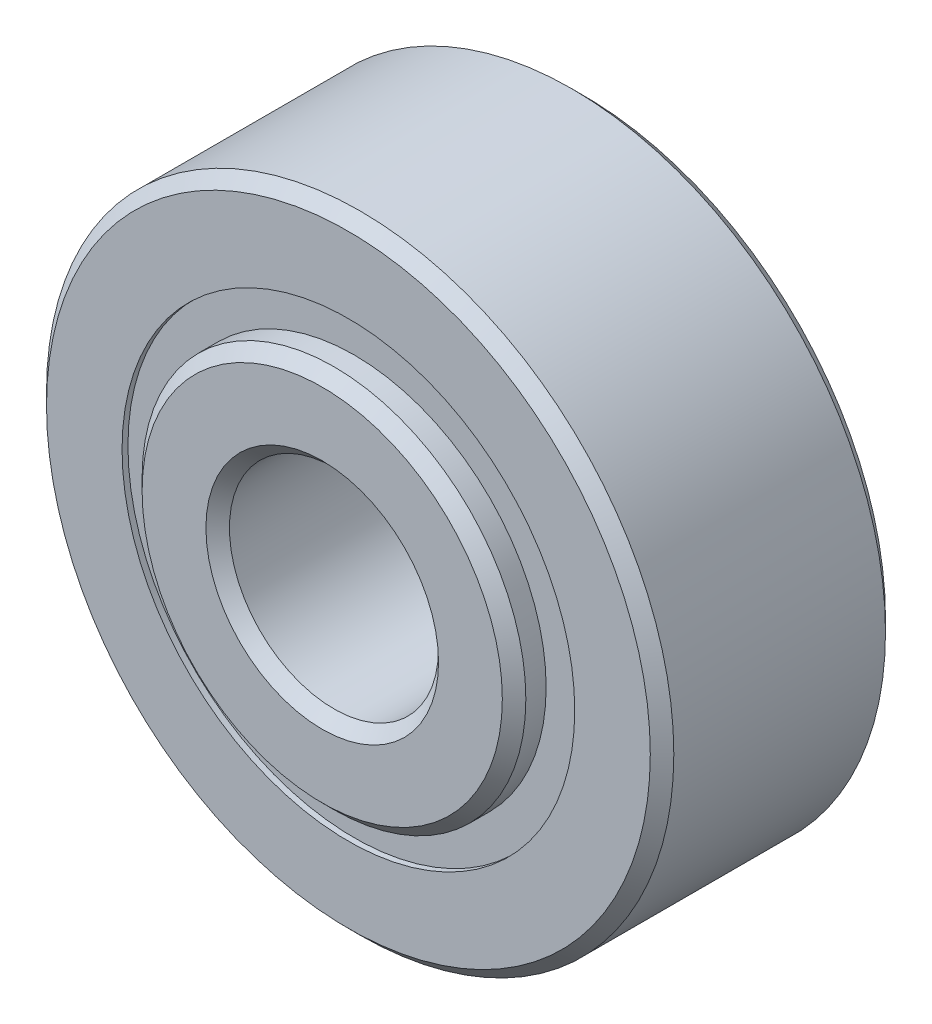
ISO-10303-21;
HEADER;
FILE_DESCRIPTION(('STEP AP214'),'2;1');
FILE_NAME('part.step','',(''),(''),'','','');
FILE_SCHEMA(('AUTOMOTIVE_DESIGN { 1 0 10303 214 1 1 1 1 }'));
ENDSEC;
DATA;
#1=APPLICATION_CONTEXT('core data for automotive mechanical design processes');
#2=APPLICATION_PROTOCOL_DEFINITION('international standard','automotive_design',2000,#1);
#3=PRODUCT_CONTEXT('',#1,'mechanical');
#4=PRODUCT('Part','Part','',(#3));
#5=PRODUCT_RELATED_PRODUCT_CATEGORY('part','',(#4));
#6=PRODUCT_DEFINITION_FORMATION('','',#4);
#7=PRODUCT_DEFINITION_CONTEXT('part definition',#1,'design');
#8=PRODUCT_DEFINITION('design','',#6,#7);
#9=PRODUCT_DEFINITION_SHAPE('','',#8);
#10=(LENGTH_UNIT() NAMED_UNIT(*) SI_UNIT(.MILLI.,.METRE.));
#11=(NAMED_UNIT(*) PLANE_ANGLE_UNIT() SI_UNIT($,.RADIAN.));
#12=(NAMED_UNIT(*) SI_UNIT($,.STERADIAN.) SOLID_ANGLE_UNIT());
#13=UNCERTAINTY_MEASURE_WITH_UNIT(LENGTH_MEASURE(1.E-05),#10,'distance_accuracy_value','');
#14=(GEOMETRIC_REPRESENTATION_CONTEXT(3) GLOBAL_UNCERTAINTY_ASSIGNED_CONTEXT((#13)) GLOBAL_UNIT_ASSIGNED_CONTEXT((#10,
#11,#12)) REPRESENTATION_CONTEXT('',''));
#15=CARTESIAN_POINT('',(0.,0.,0.));
#16=DIRECTION('',(0.,0.,1.));
#17=DIRECTION('',(1.,0.,0.));
#18=AXIS2_PLACEMENT_3D('',#15,#16,#17);
#19=CARTESIAN_POINT('',(0.,3.43670373626374,-1.696339));
#20=DIRECTION('',(0.,0.,1.));
#21=DIRECTION('',(1.,0.,0.));
#22=AXIS2_PLACEMENT_3D('',#19,#20,#21);
#23=PLANE('',#22);
#24=CARTESIAN_POINT('',(0.,0.,-1.696339));
#25=DIRECTION('',(0.,0.,1.));
#26=DIRECTION('',(1.,0.,0.));
#27=AXIS2_PLACEMENT_3D('',#24,#25,#26);
#28=CIRCLE('',#27,3.43670373626374);
#29=CARTESIAN_POINT('',(3.43670373626374,0.,-1.696339));
#30=VERTEX_POINT('',#29);
#31=EDGE_CURVE('E60',#30,#30,#28,.T.);
#32=ORIENTED_EDGE('',*,*,#31,.F.);
#33=EDGE_LOOP('',(#32));
#34=FACE_BOUND('',#33,.T.);
#35=CARTESIAN_POINT('',(0.,0.,-1.696339));
#36=DIRECTION('',(0.,0.,1.));
#37=DIRECTION('',(1.,0.,0.));
#38=AXIS2_PLACEMENT_3D('',#35,#36,#37);
#39=CIRCLE('',#38,2.91329626373626);
#40=CARTESIAN_POINT('',(2.91329626373626,0.,-1.696339));
#41=VERTEX_POINT('',#40);
#42=EDGE_CURVE('E11',#41,#41,#39,.T.);
#43=ORIENTED_EDGE('',*,*,#42,.T.);
#44=EDGE_LOOP('',(#43));
#45=FACE_BOUND('',#44,.T.);
#46=ADVANCED_FACE('F46',(#34,#45),#23,.F.);
#47=CARTESIAN_POINT('',(0.,0.,1.78562));
#48=DIRECTION('',(0.,0.,1.));
#49=DIRECTION('',(1.,0.,0.));
#50=AXIS2_PLACEMENT_3D('',#47,#48,#49);
#51=CYLINDRICAL_SURFACE('',#50,2.91329626373626);
#52=ORIENTED_EDGE('',*,*,#42,.F.);
#53=EDGE_LOOP('',(#52));
#54=FACE_BOUND('',#53,.T.);
#55=CARTESIAN_POINT('',(0.,0.,-0.8356458066058));
#56=DIRECTION('',(0.,0.,1.));
#57=DIRECTION('',(1.,0.,0.));
#58=AXIS2_PLACEMENT_3D('',#55,#56,#57);
#59=CIRCLE('',#58,2.91329626373626);
#60=CARTESIAN_POINT('',(2.91329626373626,0.,-0.8356458066058));
#61=VERTEX_POINT('',#60);
#62=EDGE_CURVE('E52',#61,#61,#59,.T.);
#63=ORIENTED_EDGE('',*,*,#62,.T.);
#64=EDGE_LOOP('',(#63));
#65=FACE_BOUND('',#64,.T.);
#66=ADVANCED_FACE('F69',(#54,#65),#51,.F.);
#67=CARTESIAN_POINT('',(0.,3.43670373626374,-0.8356458066058));
#68=DIRECTION('',(0.,0.,-1.));
#69=DIRECTION('',(-1.,0.,0.));
#70=AXIS2_PLACEMENT_3D('',#67,#68,#69);
#71=PLANE('',#70);
#72=ORIENTED_EDGE('',*,*,#62,.F.);
#73=EDGE_LOOP('',(#72));
#74=FACE_BOUND('',#73,.T.);
#75=CARTESIAN_POINT('',(0.,0.,-0.835645806605799));
#76=DIRECTION('',(0.,0.,1.));
#77=DIRECTION('',(1.,0.,0.));
#78=AXIS2_PLACEMENT_3D('',#75,#76,#77);
#79=CIRCLE('',#78,3.43670373626374);
#80=CARTESIAN_POINT('',(3.43670373626374,0.,-0.835645806605799));
#81=VERTEX_POINT('',#80);
#82=EDGE_CURVE('E56',#81,#81,#79,.T.);
#83=ORIENTED_EDGE('',*,*,#82,.T.);
#84=EDGE_LOOP('',(#83));
#85=FACE_BOUND('',#84,.T.);
#86=ADVANCED_FACE('F73',(#74,#85),#71,.F.);
#87=CARTESIAN_POINT('',(0.,0.,1.78562));
#88=DIRECTION('',(0.,0.,1.));
#89=DIRECTION('',(1.,0.,0.));
#90=AXIS2_PLACEMENT_3D('',#87,#88,#89);
#91=CYLINDRICAL_SURFACE('',#90,3.43670373626374);
#92=ORIENTED_EDGE('',*,*,#82,.F.);
#93=EDGE_LOOP('',(#92));
#94=FACE_BOUND('',#93,.T.);
#95=ORIENTED_EDGE('',*,*,#31,.T.);
#96=EDGE_LOOP('',(#95));
#97=FACE_BOUND('',#96,.T.);
#98=ADVANCED_FACE('F66',(#94,#97),#91,.T.);
#99=CLOSED_SHELL('',(#46,#66,#86,#98));
#100=MANIFOLD_SOLID_BREP('B2',#99);
#101=CARTESIAN_POINT('',(0.,3.43670373626374,1.696339));
#102=DIRECTION('',(0.,0.,-1.));
#103=DIRECTION('',(-1.,0.,0.));
#104=AXIS2_PLACEMENT_3D('',#101,#102,#103);
#105=PLANE('',#104);
#106=CARTESIAN_POINT('',(0.,0.,1.696339));
#107=DIRECTION('',(0.,0.,1.));
#108=DIRECTION('',(1.,0.,0.));
#109=AXIS2_PLACEMENT_3D('',#106,#107,#108);
#110=CIRCLE('',#109,2.91329626373626);
#111=CARTESIAN_POINT('',(2.91329626373626,0.,1.696339));
#112=VERTEX_POINT('',#111);
#113=EDGE_CURVE('E45',#112,#112,#110,.T.);
#114=ORIENTED_EDGE('',*,*,#113,.F.);
#115=EDGE_LOOP('',(#114));
#116=FACE_BOUND('',#115,.T.);
#117=CARTESIAN_POINT('',(0.,0.,1.696339));
#118=DIRECTION('',(0.,0.,1.));
#119=DIRECTION('',(1.,0.,0.));
#120=AXIS2_PLACEMENT_3D('',#117,#118,#119);
#121=CIRCLE('',#120,3.43670373626374);
#122=CARTESIAN_POINT('',(3.43670373626374,0.,1.696339));
#123=VERTEX_POINT('',#122);
#124=EDGE_CURVE('E128',#123,#123,#121,.T.);
#125=ORIENTED_EDGE('',*,*,#124,.T.);
#126=EDGE_LOOP('',(#125));
#127=FACE_BOUND('',#126,.T.);
#128=ADVANCED_FACE('F114',(#116,#127),#105,.F.);
#129=CARTESIAN_POINT('',(0.,0.,1.78562));
#130=DIRECTION('',(0.,0.,1.));
#131=DIRECTION('',(1.,0.,0.));
#132=AXIS2_PLACEMENT_3D('',#129,#130,#131);
#133=CYLINDRICAL_SURFACE('',#132,2.91329626373626);
#134=CARTESIAN_POINT('',(0.,0.,0.835645806605798));
#135=DIRECTION('',(0.,0.,1.));
#136=DIRECTION('',(1.,0.,0.));
#137=AXIS2_PLACEMENT_3D('',#134,#135,#136);
#138=CIRCLE('',#137,2.91329626373626);
#139=CARTESIAN_POINT('',(2.91329626373626,0.,0.835645806605798));
#140=VERTEX_POINT('',#139);
#141=EDGE_CURVE('E120',#140,#140,#138,.T.);
#142=ORIENTED_EDGE('',*,*,#141,.F.);
#143=EDGE_LOOP('',(#142));
#144=FACE_BOUND('',#143,.T.);
#145=ORIENTED_EDGE('',*,*,#113,.T.);
#146=EDGE_LOOP('',(#145));
#147=FACE_BOUND('',#146,.T.);
#148=ADVANCED_FACE('F143',(#144,#147),#133,.F.);
#149=CARTESIAN_POINT('',(0.,3.43670373626374,0.835645806605798));
#150=DIRECTION('',(0.,0.,1.));
#151=DIRECTION('',(1.,0.,0.));
#152=AXIS2_PLACEMENT_3D('',#149,#150,#151);
#153=PLANE('',#152);
#154=CARTESIAN_POINT('',(0.,0.,0.835645806605798));
#155=DIRECTION('',(0.,0.,1.));
#156=DIRECTION('',(1.,0.,0.));
#157=AXIS2_PLACEMENT_3D('',#154,#155,#156);
#158=CIRCLE('',#157,3.43670373626374);
#159=CARTESIAN_POINT('',(3.43670373626374,0.,0.835645806605798));
#160=VERTEX_POINT('',#159);
#161=EDGE_CURVE('E124',#160,#160,#158,.T.);
#162=ORIENTED_EDGE('',*,*,#161,.F.);
#163=EDGE_LOOP('',(#162));
#164=FACE_BOUND('',#163,.T.);
#165=ORIENTED_EDGE('',*,*,#141,.T.);
#166=EDGE_LOOP('',(#165));
#167=FACE_BOUND('',#166,.T.);
#168=ADVANCED_FACE('F138',(#164,#167),#153,.F.);
#169=CARTESIAN_POINT('',(0.,0.,1.78562));
#170=DIRECTION('',(0.,0.,1.));
#171=DIRECTION('',(1.,0.,0.));
#172=AXIS2_PLACEMENT_3D('',#169,#170,#171);
#173=CYLINDRICAL_SURFACE('',#172,3.43670373626374);
#174=ORIENTED_EDGE('',*,*,#124,.F.);
#175=EDGE_LOOP('',(#174));
#176=FACE_BOUND('',#175,.T.);
#177=ORIENTED_EDGE('',*,*,#161,.T.);
#178=EDGE_LOOP('',(#177));
#179=FACE_BOUND('',#178,.T.);
#180=ADVANCED_FACE('F135',(#176,#179),#173,.T.);
#181=CLOSED_SHELL('',(#128,#148,#168,#180));
#182=MANIFOLD_SOLID_BREP('B6',#181);
#183=CARTESIAN_POINT('',(-1.86621817602857,2.56862895714048,0.));
#184=DIRECTION('',(0.,0.,1.));
#185=DIRECTION('',(-0.587785252292462,0.809016994374955,0.));
#186=AXIS2_PLACEMENT_3D('',#183,#184,#185);
#187=SPHERICAL_SURFACE('',#186,0.835645806605799);
#188=CARTESIAN_POINT('',(-1.86621817602857,2.56862895714048,0.835645806605798));
#189=VERTEX_POINT('',#188);
#190=VERTEX_LOOP('',#189);
#191=FACE_BOUND('',#190,.T.);
#192=ADVANCED_FACE('F181',(#191),#187,.T.);
#193=CLOSED_SHELL('',(#192));
#194=MANIFOLD_SOLID_BREP('B40',#193);
#195=CARTESIAN_POINT('',(-3.0196044392371,0.981128957140492,0.));
#196=DIRECTION('',(0.,0.,1.));
#197=DIRECTION('',(-0.95105651629515,0.309016994374958,0.));
#198=AXIS2_PLACEMENT_3D('',#195,#196,#197);
#199=SPHERICAL_SURFACE('',#198,0.835645806605799);
#200=CARTESIAN_POINT('',(-3.0196044392371,0.981128957140492,0.835645806605798));
#201=VERTEX_POINT('',#200);
#202=VERTEX_LOOP('',#201);
#203=FACE_BOUND('',#202,.T.);
#204=ADVANCED_FACE('F201',(#203),#199,.T.);
#205=CLOSED_SHELL('',(#204));
#206=MANIFOLD_SOLID_BREP('B110',#205);
#207=CARTESIAN_POINT('',(-3.01960443923712,-0.981128957140429,0.));
#208=DIRECTION('',(0.,0.,1.));
#209=DIRECTION('',(-0.951056516295157,-0.309016994374938,0.));
#210=AXIS2_PLACEMENT_3D('',#207,#208,#209);
#211=SPHERICAL_SURFACE('',#210,0.835645806605799);
#212=CARTESIAN_POINT('',(-3.01960443923712,-0.981128957140429,0.835645806605798));
#213=VERTEX_POINT('',#212);
#214=VERTEX_LOOP('',#213);
#215=FACE_BOUND('',#214,.T.);
#216=ADVANCED_FACE('F221',(#215),#211,.T.);
#217=CLOSED_SHELL('',(#216));
#218=MANIFOLD_SOLID_BREP('B177',#217);
#219=CARTESIAN_POINT('',(-1.86621817602862,-2.56862895714044,0.));
#220=DIRECTION('',(0.,0.,1.));
#221=DIRECTION('',(-0.58778525229248,-0.809016994374942,0.));
#222=AXIS2_PLACEMENT_3D('',#219,#220,#221);
#223=SPHERICAL_SURFACE('',#222,0.835645806605799);
#224=CARTESIAN_POINT('',(-1.86621817602862,-2.56862895714044,0.835645806605798));
#225=VERTEX_POINT('',#224);
#226=VERTEX_LOOP('',#225);
#227=FACE_BOUND('',#226,.T.);
#228=ADVANCED_FACE('F241',(#227),#223,.T.);
#229=CLOSED_SHELL('',(#228));
#230=MANIFOLD_SOLID_BREP('B197',#229);
#231=CARTESIAN_POINT('',(0.,-3.175,0.));
#232=DIRECTION('',(0.,0.,1.));
#233=DIRECTION('',(0.,-1.,0.));
#234=AXIS2_PLACEMENT_3D('',#231,#232,#233);
#235=SPHERICAL_SURFACE('',#234,0.835645806605799);
#236=CARTESIAN_POINT('',(0.,-3.175,0.835645806605798));
#237=VERTEX_POINT('',#236);
#238=VERTEX_LOOP('',#237);
#239=FACE_BOUND('',#238,.T.);
#240=ADVANCED_FACE('F261',(#239),#235,.T.);
#241=CLOSED_SHELL('',(#240));
#242=MANIFOLD_SOLID_BREP('B217',#241);
#243=CARTESIAN_POINT('',(1.86621817602859,-2.56862895714047,0.));
#244=DIRECTION('',(0.,0.,1.));
#245=DIRECTION('',(0.587785252292469,-0.809016994374951,0.));
#246=AXIS2_PLACEMENT_3D('',#243,#244,#245);
#247=SPHERICAL_SURFACE('',#246,0.835645806605799);
#248=CARTESIAN_POINT('',(1.86621817602859,-2.56862895714047,0.835645806605798));
#249=VERTEX_POINT('',#248);
#250=VERTEX_LOOP('',#249);
#251=FACE_BOUND('',#250,.T.);
#252=ADVANCED_FACE('F281',(#251),#247,.T.);
#253=CLOSED_SHELL('',(#252));
#254=MANIFOLD_SOLID_BREP('B237',#253);
#255=CARTESIAN_POINT('',(3.01960443923711,-0.981128957140471,0.));
#256=DIRECTION('',(0.,0.,1.));
#257=DIRECTION('',(0.951056516295152,-0.309016994374952,0.));
#258=AXIS2_PLACEMENT_3D('',#255,#256,#257);
#259=SPHERICAL_SURFACE('',#258,0.835645806605799);
#260=CARTESIAN_POINT('',(3.01960443923711,-0.981128957140471,0.835645806605798));
#261=VERTEX_POINT('',#260);
#262=VERTEX_LOOP('',#261);
#263=FACE_BOUND('',#262,.T.);
#264=ADVANCED_FACE('F301',(#263),#259,.T.);
#265=CLOSED_SHELL('',(#264));
#266=MANIFOLD_SOLID_BREP('B257',#265);
#267=CARTESIAN_POINT('',(3.01960443923712,0.98112895714045,0.));
#268=DIRECTION('',(0.,0.,1.));
#269=DIRECTION('',(0.951056516295155,0.309016994374945,0.));
#270=AXIS2_PLACEMENT_3D('',#267,#268,#269);
#271=SPHERICAL_SURFACE('',#270,0.835645806605799);
#272=CARTESIAN_POINT('',(3.01960443923712,0.98112895714045,0.835645806605798));
#273=VERTEX_POINT('',#272);
#274=VERTEX_LOOP('',#273);
#275=FACE_BOUND('',#274,.T.);
#276=ADVANCED_FACE('F321',(#275),#271,.T.);
#277=CLOSED_SHELL('',(#276));
#278=MANIFOLD_SOLID_BREP('B277',#277);
#279=CARTESIAN_POINT('',(1.86621817602861,2.56862895714046,0.));
#280=DIRECTION('',(0.,0.,1.));
#281=DIRECTION('',(0.587785252292474,0.809016994374947,0.));
#282=AXIS2_PLACEMENT_3D('',#279,#280,#281);
#283=SPHERICAL_SURFACE('',#282,0.835645806605799);
#284=CARTESIAN_POINT('',(1.86621817602861,2.56862895714046,0.835645806605798));
#285=VERTEX_POINT('',#284);
#286=VERTEX_LOOP('',#285);
#287=FACE_BOUND('',#286,.T.);
#288=ADVANCED_FACE('F341',(#287),#283,.T.);
#289=CLOSED_SHELL('',(#288));
#290=MANIFOLD_SOLID_BREP('B297',#289);
#291=CARTESIAN_POINT('',(0.,3.175,0.));
#292=DIRECTION('',(0.,0.,1.));
#293=DIRECTION('',(0.,1.,0.));
#294=AXIS2_PLACEMENT_3D('',#291,#292,#293);
#295=SPHERICAL_SURFACE('',#294,0.835645806605799);
#296=CARTESIAN_POINT('',(0.,3.175,0.835645806605798));
#297=VERTEX_POINT('',#296);
#298=VERTEX_LOOP('',#297);
#299=FACE_BOUND('',#298,.T.);
#300=ADVANCED_FACE('F364',(#299),#295,.T.);
#301=CLOSED_SHELL('',(#300));
#302=MANIFOLD_SOLID_BREP('B317',#301);
#303=CARTESIAN_POINT('',(0.,0.,2.004568));
#304=DIRECTION('',(0.,0.,-1.));
#305=DIRECTION('',(-1.,0.,0.));
#306=AXIS2_PLACEMENT_3D('',#303,#304,#305);
#307=CONICAL_SURFACE('',#306,2.91329626373626,0.785398163397448);
#308=CARTESIAN_POINT('',(0.,0.,2.18313));
#309=DIRECTION('',(0.,0.,1.));
#310=DIRECTION('',(1.,0.,0.));
#311=AXIS2_PLACEMENT_3D('',#308,#309,#310);
#312=CIRCLE('',#311,2.73473426373626);
#313=CARTESIAN_POINT('',(2.73473426373626,0.,2.18313));
#314=VERTEX_POINT('',#313);
#315=EDGE_CURVE('E418',#314,#314,#312,.T.);
#316=ORIENTED_EDGE('',*,*,#315,.F.);
#317=EDGE_LOOP('',(#316));
#318=FACE_BOUND('',#317,.T.);
#319=CARTESIAN_POINT('',(0.,0.,2.004568));
#320=DIRECTION('',(0.,0.,1.));
#321=DIRECTION('',(1.,0.,0.));
#322=AXIS2_PLACEMENT_3D('',#319,#320,#321);
#323=CIRCLE('',#322,2.91329626373626);
#324=CARTESIAN_POINT('',(2.91329626373626,0.,2.004568));
#325=VERTEX_POINT('',#324);
#326=EDGE_CURVE('E363',#325,#325,#323,.T.);
#327=ORIENTED_EDGE('',*,*,#326,.T.);
#328=EDGE_LOOP('',(#327));
#329=FACE_BOUND('',#328,.T.);
#330=ADVANCED_FACE('F384',(#318,#329),#307,.T.);
#331=CARTESIAN_POINT('',(0.,0.,1.78562));
#332=DIRECTION('',(0.,0.,1.));
#333=DIRECTION('',(1.,0.,0.));
#334=AXIS2_PLACEMENT_3D('',#331,#332,#333);
#335=CYLINDRICAL_SURFACE('',#334,2.91329626373626);
#336=ORIENTED_EDGE('',*,*,#326,.F.);
#337=EDGE_LOOP('',(#336));
#338=FACE_BOUND('',#337,.T.);
#339=CARTESIAN_POINT('',(0.,0.,0.793608888888888));
#340=DIRECTION('',(0.,0.,1.));
#341=DIRECTION('',(1.,0.,0.));
#342=AXIS2_PLACEMENT_3D('',#339,#340,#341);
#343=CIRCLE('',#342,2.91329626373626);
#344=CARTESIAN_POINT('',(2.91329626373626,0.,0.793608888888888));
#345=VERTEX_POINT('',#344);
#346=EDGE_CURVE('E390',#345,#345,#343,.T.);
#347=ORIENTED_EDGE('',*,*,#346,.T.);
#348=EDGE_LOOP('',(#347));
#349=FACE_BOUND('',#348,.T.);
#350=ADVANCED_FACE('F425',(#338,#349),#335,.T.);
#351=CARTESIAN_POINT('',(0.,0.,0.));
#352=DIRECTION('',(0.,0.,1.));
#353=DIRECTION('',(1.,0.,0.));
#354=AXIS2_PLACEMENT_3D('',#351,#352,#353);
#355=TOROIDAL_SURFACE('',#354,3.17499999999999,0.835645806605797);
#356=ORIENTED_EDGE('',*,*,#346,.F.);
#357=EDGE_LOOP('',(#356));
#358=FACE_BOUND('',#357,.T.);
#359=CARTESIAN_POINT('',(0.,0.,-0.793608888888889));
#360=DIRECTION('',(0.,0.,1.));
#361=DIRECTION('',(1.,0.,0.));
#362=AXIS2_PLACEMENT_3D('',#359,#360,#361);
#363=CIRCLE('',#362,2.91329626373626);
#364=CARTESIAN_POINT('',(2.91329626373626,0.,-0.793608888888889));
#365=VERTEX_POINT('',#364);
#366=EDGE_CURVE('E394',#365,#365,#363,.T.);
#367=ORIENTED_EDGE('',*,*,#366,.T.);
#368=EDGE_LOOP('',(#367));
#369=FACE_BOUND('',#368,.T.);
#370=ADVANCED_FACE('F429',(#358,#369),#355,.F.);
#371=CARTESIAN_POINT('',(0.,0.,1.78562));
#372=DIRECTION('',(0.,0.,1.));
#373=DIRECTION('',(1.,0.,0.));
#374=AXIS2_PLACEMENT_3D('',#371,#372,#373);
#375=CYLINDRICAL_SURFACE('',#374,2.91329626373626);
#376=ORIENTED_EDGE('',*,*,#366,.F.);
#377=EDGE_LOOP('',(#376));
#378=FACE_BOUND('',#377,.T.);
#379=CARTESIAN_POINT('',(0.,0.,-2.004568));
#380=DIRECTION('',(0.,0.,1.));
#381=DIRECTION('',(1.,0.,0.));
#382=AXIS2_PLACEMENT_3D('',#379,#380,#381);
#383=CIRCLE('',#382,2.91329626373626);
#384=CARTESIAN_POINT('',(2.91329626373626,0.,-2.004568));
#385=VERTEX_POINT('',#384);
#386=EDGE_CURVE('E398',#385,#385,#383,.T.);
#387=ORIENTED_EDGE('',*,*,#386,.T.);
#388=EDGE_LOOP('',(#387));
#389=FACE_BOUND('',#388,.T.);
#390=ADVANCED_FACE('F434',(#378,#389),#375,.T.);
#391=CARTESIAN_POINT('',(0.,0.,-2.18313));
#392=DIRECTION('',(0.,0.,1.));
#393=DIRECTION('',(1.,0.,0.));
#394=AXIS2_PLACEMENT_3D('',#391,#392,#393);
#395=CONICAL_SURFACE('',#394,2.73473426373626,0.785398163397447);
#396=ORIENTED_EDGE('',*,*,#386,.F.);
#397=EDGE_LOOP('',(#396));
#398=FACE_BOUND('',#397,.T.);
#399=CARTESIAN_POINT('',(0.,0.,-2.18313));
#400=DIRECTION('',(0.,0.,1.));
#401=DIRECTION('',(1.,0.,0.));
#402=AXIS2_PLACEMENT_3D('',#399,#400,#401);
#403=CIRCLE('',#402,2.73473426373626);
#404=CARTESIAN_POINT('',(2.73473426373626,0.,-2.18313));
#405=VERTEX_POINT('',#404);
#406=EDGE_CURVE('E403',#405,#405,#403,.T.);
#407=ORIENTED_EDGE('',*,*,#406,.T.);
#408=EDGE_LOOP('',(#407));
#409=FACE_BOUND('',#408,.T.);
#410=ADVANCED_FACE('F440',(#398,#409),#395,.T.);
#411=CARTESIAN_POINT('',(0.,2.73473426373626,-2.18313));
#412=DIRECTION('',(0.,0.,1.));
#413=DIRECTION('',(1.,0.,0.));
#414=AXIS2_PLACEMENT_3D('',#411,#412,#413);
#415=PLANE('',#414);
#416=ORIENTED_EDGE('',*,*,#406,.F.);
#417=EDGE_LOOP('',(#416));
#418=FACE_BOUND('',#417,.T.);
#419=CARTESIAN_POINT('',(0.,0.,-2.18313));
#420=DIRECTION('',(0.,0.,1.));
#421=DIRECTION('',(1.,0.,0.));
#422=AXIS2_PLACEMENT_3D('',#419,#420,#421);
#423=CIRCLE('',#422,1.766062);
#424=CARTESIAN_POINT('',(1.766062,0.,-2.18313));
#425=VERTEX_POINT('',#424);
#426=EDGE_CURVE('E406',#425,#425,#423,.T.);
#427=ORIENTED_EDGE('',*,*,#426,.T.);
#428=EDGE_LOOP('',(#427));
#429=FACE_BOUND('',#428,.T.);
#430=ADVANCED_FACE('F444',(#418,#429),#415,.F.);
#431=CARTESIAN_POINT('',(0.,0.,-2.004568));
#432=DIRECTION('',(0.,0.,-1.));
#433=DIRECTION('',(-1.,0.,0.));
#434=AXIS2_PLACEMENT_3D('',#431,#432,#433);
#435=CONICAL_SURFACE('',#434,1.5875,0.785398163397447);
#436=ORIENTED_EDGE('',*,*,#426,.F.);
#437=EDGE_LOOP('',(#436));
#438=FACE_BOUND('',#437,.T.);
#439=CARTESIAN_POINT('',(0.,0.,-2.004568));
#440=DIRECTION('',(0.,0.,1.));
#441=DIRECTION('',(1.,0.,0.));
#442=AXIS2_PLACEMENT_3D('',#439,#440,#441);
#443=CIRCLE('',#442,1.5875);
#444=CARTESIAN_POINT('',(1.5875,0.,-2.004568));
#445=VERTEX_POINT('',#444);
#446=EDGE_CURVE('E409',#445,#445,#443,.T.);
#447=ORIENTED_EDGE('',*,*,#446,.T.);
#448=EDGE_LOOP('',(#447));
#449=FACE_BOUND('',#448,.T.);
#450=ADVANCED_FACE('F448',(#438,#449),#435,.F.);
#451=CARTESIAN_POINT('',(0.,0.,1.78562));
#452=DIRECTION('',(0.,0.,1.));
#453=DIRECTION('',(1.,0.,0.));
#454=AXIS2_PLACEMENT_3D('',#451,#452,#453);
#455=CYLINDRICAL_SURFACE('',#454,1.5875);
#456=ORIENTED_EDGE('',*,*,#446,.F.);
#457=EDGE_LOOP('',(#456));
#458=FACE_BOUND('',#457,.T.);
#459=CARTESIAN_POINT('',(0.,0.,2.004568));
#460=DIRECTION('',(0.,0.,1.));
#461=DIRECTION('',(1.,0.,0.));
#462=AXIS2_PLACEMENT_3D('',#459,#460,#461);
#463=CIRCLE('',#462,1.5875);
#464=CARTESIAN_POINT('',(1.5875,0.,2.004568));
#465=VERTEX_POINT('',#464);
#466=EDGE_CURVE('E412',#465,#465,#463,.T.);
#467=ORIENTED_EDGE('',*,*,#466,.T.);
#468=EDGE_LOOP('',(#467));
#469=FACE_BOUND('',#468,.T.);
#470=ADVANCED_FACE('F452',(#458,#469),#455,.F.);
#471=CARTESIAN_POINT('',(0.,0.,2.18313));
#472=DIRECTION('',(0.,0.,1.));
#473=DIRECTION('',(1.,0.,0.));
#474=AXIS2_PLACEMENT_3D('',#471,#472,#473);
#475=CONICAL_SURFACE('',#474,1.766062,0.785398163397451);
#476=ORIENTED_EDGE('',*,*,#466,.F.);
#477=EDGE_LOOP('',(#476));
#478=FACE_BOUND('',#477,.T.);
#479=CARTESIAN_POINT('',(0.,0.,2.18313));
#480=DIRECTION('',(0.,0.,1.));
#481=DIRECTION('',(1.,0.,0.));
#482=AXIS2_PLACEMENT_3D('',#479,#480,#481);
#483=CIRCLE('',#482,1.766062);
#484=CARTESIAN_POINT('',(1.766062,0.,2.18313));
#485=VERTEX_POINT('',#484);
#486=EDGE_CURVE('E415',#485,#485,#483,.T.);
#487=ORIENTED_EDGE('',*,*,#486,.T.);
#488=EDGE_LOOP('',(#487));
#489=FACE_BOUND('',#488,.T.);
#490=ADVANCED_FACE('F456',(#478,#489),#475,.F.);
#491=CARTESIAN_POINT('',(0.,1.766062,2.18313));
#492=DIRECTION('',(0.,0.,-1.));
#493=DIRECTION('',(-1.,0.,0.));
#494=AXIS2_PLACEMENT_3D('',#491,#492,#493);
#495=PLANE('',#494);
#496=ORIENTED_EDGE('',*,*,#486,.F.);
#497=EDGE_LOOP('',(#496));
#498=FACE_BOUND('',#497,.T.);
#499=ORIENTED_EDGE('',*,*,#315,.T.);
#500=EDGE_LOOP('',(#499));
#501=FACE_BOUND('',#500,.T.);
#502=ADVANCED_FACE('F422',(#498,#501),#495,.F.);
#503=CLOSED_SHELL('',(#330,#350,#370,#390,#410,#430,#450,#470,#490,#502));
#504=MANIFOLD_SOLID_BREP('B337',#503);
#505=CARTESIAN_POINT('',(0.,0.,1.607058));
#506=DIRECTION('',(0.,0.,-1.));
#507=DIRECTION('',(-1.,0.,0.));
#508=AXIS2_PLACEMENT_3D('',#505,#506,#507);
#509=CONICAL_SURFACE('',#508,4.7625,0.785398163397449);
#510=CARTESIAN_POINT('',(0.,0.,1.78562));
#511=DIRECTION('',(0.,0.,1.));
#512=DIRECTION('',(1.,0.,0.));
#513=AXIS2_PLACEMENT_3D('',#510,#511,#512);
#514=CIRCLE('',#513,4.583938);
#515=CARTESIAN_POINT('',(4.583938,0.,1.78562));
#516=VERTEX_POINT('',#515);
#517=EDGE_CURVE('E564',#516,#516,#514,.T.);
#518=ORIENTED_EDGE('',*,*,#517,.F.);
#519=EDGE_LOOP('',(#518));
#520=FACE_BOUND('',#519,.T.);
#521=CARTESIAN_POINT('',(0.,0.,1.607058));
#522=DIRECTION('',(0.,0.,1.));
#523=DIRECTION('',(1.,0.,0.));
#524=AXIS2_PLACEMENT_3D('',#521,#522,#523);
#525=CIRCLE('',#524,4.7625);
#526=CARTESIAN_POINT('',(4.7625,0.,1.607058));
#527=VERTEX_POINT('',#526);
#528=EDGE_CURVE('E383',#527,#527,#525,.T.);
#529=ORIENTED_EDGE('',*,*,#528,.T.);
#530=EDGE_LOOP('',(#529));
#531=FACE_BOUND('',#530,.T.);
#532=ADVANCED_FACE('F536',(#520,#531),#509,.T.);
#533=CARTESIAN_POINT('',(0.,0.,1.78562));
#534=DIRECTION('',(0.,0.,1.));
#535=DIRECTION('',(1.,0.,0.));
#536=AXIS2_PLACEMENT_3D('',#533,#534,#535);
#537=CYLINDRICAL_SURFACE('',#536,4.7625);
#538=ORIENTED_EDGE('',*,*,#528,.F.);
#539=EDGE_LOOP('',(#538));
#540=FACE_BOUND('',#539,.T.);
#541=CARTESIAN_POINT('',(0.,0.,-1.607058));
#542=DIRECTION('',(0.,0.,1.));
#543=DIRECTION('',(1.,0.,0.));
#544=AXIS2_PLACEMENT_3D('',#541,#542,#543);
#545=CIRCLE('',#544,4.7625);
#546=CARTESIAN_POINT('',(4.7625,0.,-1.607058));
#547=VERTEX_POINT('',#546);
#548=EDGE_CURVE('E542',#547,#547,#545,.T.);
#549=ORIENTED_EDGE('',*,*,#548,.T.);
#550=EDGE_LOOP('',(#549));
#551=FACE_BOUND('',#550,.T.);
#552=ADVANCED_FACE('F571',(#540,#551),#537,.T.);
#553=CARTESIAN_POINT('',(0.,0.,-1.78562));
#554=DIRECTION('',(0.,0.,1.));
#555=DIRECTION('',(1.,0.,0.));
#556=AXIS2_PLACEMENT_3D('',#553,#554,#555);
#557=CONICAL_SURFACE('',#556,4.583938,0.785398163397447);
#558=ORIENTED_EDGE('',*,*,#548,.F.);
#559=EDGE_LOOP('',(#558));
#560=FACE_BOUND('',#559,.T.);
#561=CARTESIAN_POINT('',(0.,0.,-1.78562));
#562=DIRECTION('',(0.,0.,1.));
#563=DIRECTION('',(1.,0.,0.));
#564=AXIS2_PLACEMENT_3D('',#561,#562,#563);
#565=CIRCLE('',#564,4.583938);
#566=CARTESIAN_POINT('',(4.583938,0.,-1.78562));
#567=VERTEX_POINT('',#566);
#568=EDGE_CURVE('E546',#567,#567,#565,.T.);
#569=ORIENTED_EDGE('',*,*,#568,.T.);
#570=EDGE_LOOP('',(#569));
#571=FACE_BOUND('',#570,.T.);
#572=ADVANCED_FACE('F575',(#560,#571),#557,.T.);
#573=CARTESIAN_POINT('',(0.,4.583938,-1.78562));
#574=DIRECTION('',(0.,0.,1.));
#575=DIRECTION('',(1.,0.,0.));
#576=AXIS2_PLACEMENT_3D('',#573,#574,#575);
#577=PLANE('',#576);
#578=ORIENTED_EDGE('',*,*,#568,.F.);
#579=EDGE_LOOP('',(#578));
#580=FACE_BOUND('',#579,.T.);
#581=CARTESIAN_POINT('',(0.,0.,-1.78562));
#582=DIRECTION('',(0.,0.,1.));
#583=DIRECTION('',(1.,0.,0.));
#584=AXIS2_PLACEMENT_3D('',#581,#582,#583);
#585=CIRCLE('',#584,3.43670373626374);
#586=CARTESIAN_POINT('',(3.43670373626374,0.,-1.78562));
#587=VERTEX_POINT('',#586);
#588=EDGE_CURVE('E550',#587,#587,#585,.T.);
#589=ORIENTED_EDGE('',*,*,#588,.T.);
#590=EDGE_LOOP('',(#589));
#591=FACE_BOUND('',#590,.T.);
#592=ADVANCED_FACE('F580',(#580,#591),#577,.F.);
#593=CARTESIAN_POINT('',(0.,0.,1.78562));
#594=DIRECTION('',(0.,0.,1.));
#595=DIRECTION('',(1.,0.,0.));
#596=AXIS2_PLACEMENT_3D('',#593,#594,#595);
#597=CYLINDRICAL_SURFACE('',#596,3.43670373626374);
#598=ORIENTED_EDGE('',*,*,#588,.F.);
#599=EDGE_LOOP('',(#598));
#600=FACE_BOUND('',#599,.T.);
#601=CARTESIAN_POINT('',(0.,0.,-0.793608888888889));
#602=DIRECTION('',(0.,0.,1.));
#603=DIRECTION('',(1.,0.,0.));
#604=AXIS2_PLACEMENT_3D('',#601,#602,#603);
#605=CIRCLE('',#604,3.43670373626374);
#606=CARTESIAN_POINT('',(3.43670373626374,0.,-0.793608888888889));
#607=VERTEX_POINT('',#606);
#608=EDGE_CURVE('E555',#607,#607,#605,.T.);
#609=ORIENTED_EDGE('',*,*,#608,.T.);
#610=EDGE_LOOP('',(#609));
#611=FACE_BOUND('',#610,.T.);
#612=ADVANCED_FACE('F586',(#600,#611),#597,.F.);
#613=CARTESIAN_POINT('',(0.,0.,0.));
#614=DIRECTION('',(0.,0.,1.));
#615=DIRECTION('',(1.,0.,0.));
#616=AXIS2_PLACEMENT_3D('',#613,#614,#615);
#617=TOROIDAL_SURFACE('',#616,3.175,0.835645806605799);
#618=ORIENTED_EDGE('',*,*,#608,.F.);
#619=EDGE_LOOP('',(#618));
#620=FACE_BOUND('',#619,.T.);
#621=CARTESIAN_POINT('',(0.,0.,0.793608888888888));
#622=DIRECTION('',(0.,0.,1.));
#623=DIRECTION('',(1.,0.,0.));
#624=AXIS2_PLACEMENT_3D('',#621,#622,#623);
#625=CIRCLE('',#624,3.43670373626374);
#626=CARTESIAN_POINT('',(3.43670373626374,0.,0.793608888888888));
#627=VERTEX_POINT('',#626);
#628=EDGE_CURVE('E558',#627,#627,#625,.T.);
#629=ORIENTED_EDGE('',*,*,#628,.T.);
#630=EDGE_LOOP('',(#629));
#631=FACE_BOUND('',#630,.T.);
#632=ADVANCED_FACE('F590',(#620,#631),#617,.F.);
#633=CARTESIAN_POINT('',(0.,0.,1.78562));
#634=DIRECTION('',(0.,0.,1.));
#635=DIRECTION('',(1.,0.,0.));
#636=AXIS2_PLACEMENT_3D('',#633,#634,#635);
#637=CYLINDRICAL_SURFACE('',#636,3.43670373626374);
#638=ORIENTED_EDGE('',*,*,#628,.F.);
#639=EDGE_LOOP('',(#638));
#640=FACE_BOUND('',#639,.T.);
#641=CARTESIAN_POINT('',(0.,0.,1.78562));
#642=DIRECTION('',(0.,0.,1.));
#643=DIRECTION('',(1.,0.,0.));
#644=AXIS2_PLACEMENT_3D('',#641,#642,#643);
#645=CIRCLE('',#644,3.43670373626374);
#646=CARTESIAN_POINT('',(3.43670373626374,0.,1.78562));
#647=VERTEX_POINT('',#646);
#648=EDGE_CURVE('E561',#647,#647,#645,.T.);
#649=ORIENTED_EDGE('',*,*,#648,.T.);
#650=EDGE_LOOP('',(#649));
#651=FACE_BOUND('',#650,.T.);
#652=ADVANCED_FACE('F594',(#640,#651),#637,.F.);
#653=CARTESIAN_POINT('',(0.,4.583938,1.78562));
#654=DIRECTION('',(0.,0.,-1.));
#655=DIRECTION('',(-1.,0.,0.));
#656=AXIS2_PLACEMENT_3D('',#653,#654,#655);
#657=PLANE('',#656);
#658=ORIENTED_EDGE('',*,*,#648,.F.);
#659=EDGE_LOOP('',(#658));
#660=FACE_BOUND('',#659,.T.);
#661=ORIENTED_EDGE('',*,*,#517,.T.);
#662=EDGE_LOOP('',(#661));
#663=FACE_BOUND('',#662,.T.);
#664=ADVANCED_FACE('F568',(#660,#663),#657,.F.);
#665=CLOSED_SHELL('',(#532,#552,#572,#592,#612,#632,#652,#664));
#666=MANIFOLD_SOLID_BREP('B358',#665);
#667=ADVANCED_BREP_SHAPE_REPRESENTATION('',(#18,#100,#182,#194,#206,#218,#230,#242,#254,#266,
#278,#290,#302,#504,#666),#14);
#668=SHAPE_DEFINITION_REPRESENTATION(#9,#667);
ENDSEC;
END-ISO-10303-21;
